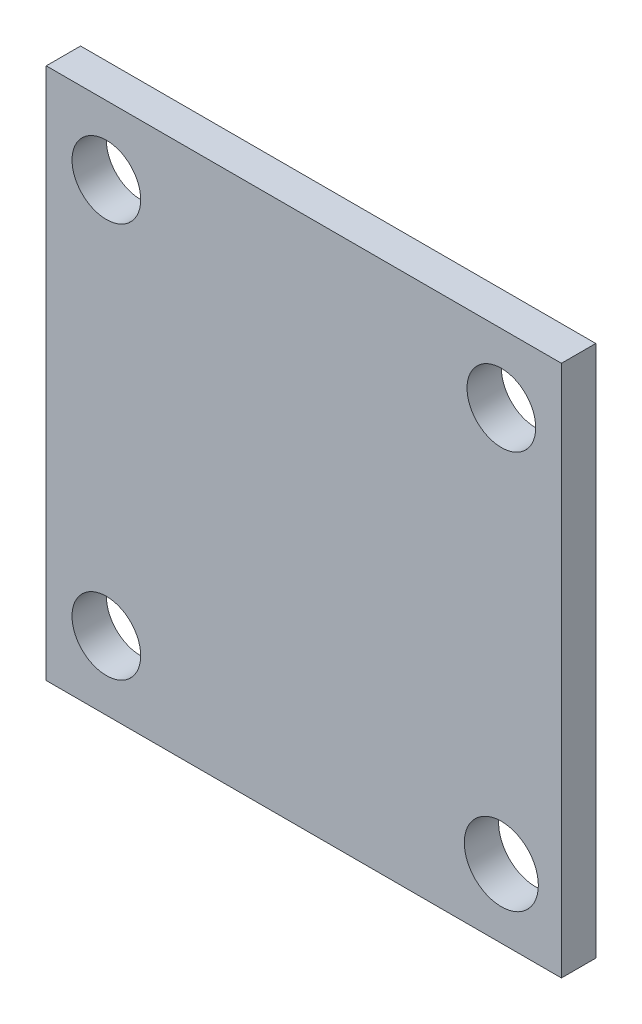
ISO-10303-21;
HEADER;
FILE_DESCRIPTION(('STEP AP214'),'2;1');
FILE_NAME('part.step','',(''),(''),'','','');
FILE_SCHEMA(('AUTOMOTIVE_DESIGN { 1 0 10303 214 1 1 1 1 }'));
ENDSEC;
DATA;
#1=APPLICATION_CONTEXT('core data for automotive mechanical design processes');
#2=APPLICATION_PROTOCOL_DEFINITION('international standard','automotive_design',2000,#1);
#3=PRODUCT_CONTEXT('',#1,'mechanical');
#4=PRODUCT('Part','Part','',(#3));
#5=PRODUCT_RELATED_PRODUCT_CATEGORY('part','',(#4));
#6=PRODUCT_DEFINITION_FORMATION('','',#4);
#7=PRODUCT_DEFINITION_CONTEXT('part definition',#1,'design');
#8=PRODUCT_DEFINITION('design','',#6,#7);
#9=PRODUCT_DEFINITION_SHAPE('','',#8);
#10=(LENGTH_UNIT() NAMED_UNIT(*) SI_UNIT(.MILLI.,.METRE.));
#11=(NAMED_UNIT(*) PLANE_ANGLE_UNIT() SI_UNIT($,.RADIAN.));
#12=(NAMED_UNIT(*) SI_UNIT($,.STERADIAN.) SOLID_ANGLE_UNIT());
#13=UNCERTAINTY_MEASURE_WITH_UNIT(LENGTH_MEASURE(1.E-05),#10,'distance_accuracy_value','');
#14=(GEOMETRIC_REPRESENTATION_CONTEXT(3) GLOBAL_UNCERTAINTY_ASSIGNED_CONTEXT((#13)) GLOBAL_UNIT_ASSIGNED_CONTEXT((#10,
#11,#12)) REPRESENTATION_CONTEXT('',''));
#15=CARTESIAN_POINT('',(0.,0.,0.));
#16=DIRECTION('',(0.,0.,1.));
#17=DIRECTION('',(1.,0.,0.));
#18=AXIS2_PLACEMENT_3D('',#15,#16,#17);
#19=CARTESIAN_POINT('',(0.,0.,2.));
#20=DIRECTION('',(0.,0.,1.));
#21=DIRECTION('',(1.,0.,0.));
#22=AXIS2_PLACEMENT_3D('',#19,#20,#21);
#23=PLANE('',#22);
#24=CARTESIAN_POINT('',(-11.501091744182,-11.4989082558181,2.));
#25=DIRECTION('',(0.,0.,1.));
#26=DIRECTION('',(1.,0.,0.));
#27=AXIS2_PLACEMENT_3D('',#24,#25,#26);
#28=CIRCLE('',#27,2.);
#29=CARTESIAN_POINT('',(-9.50109174418201,-11.4989082558181,2.));
#30=VERTEX_POINT('',#29);
#31=EDGE_CURVE('E142',#30,#30,#28,.T.);
#32=ORIENTED_EDGE('',*,*,#31,.F.);
#33=EDGE_LOOP('',(#32));
#34=FACE_BOUND('',#33,.T.);
#35=CARTESIAN_POINT('',(-11.4989082558179,11.5032752325463,2.));
#36=DIRECTION('',(0.,0.,1.));
#37=DIRECTION('',(1.,0.,0.));
#38=AXIS2_PLACEMENT_3D('',#35,#36,#37);
#39=CIRCLE('',#38,2.);
#40=CARTESIAN_POINT('',(-9.49890825581793,11.5032752325463,2.));
#41=VERTEX_POINT('',#40);
#42=EDGE_CURVE('E112',#41,#41,#39,.T.);
#43=ORIENTED_EDGE('',*,*,#42,.F.);
#44=EDGE_LOOP('',(#43));
#45=FACE_BOUND('',#44,.T.);
#46=DIRECTION('',(0.,1.,0.));
#47=VECTOR('',#46,1.);
#48=CARTESIAN_POINT('',(15.001091744182,-15.5010917441821,2.));
#49=LINE('',#48,#47);
#50=CARTESIAN_POINT('',(15.001091744182,-15.5010917441821,2.));
#51=VERTEX_POINT('',#50);
#52=CARTESIAN_POINT('',(15.001091744182,15.5010917441821,2.));
#53=VERTEX_POINT('',#52);
#54=EDGE_CURVE('E92',#51,#53,#49,.T.);
#55=ORIENTED_EDGE('',*,*,#54,.T.);
#56=DIRECTION('',(-1.,0.,0.));
#57=VECTOR('',#56,1.);
#58=CARTESIAN_POINT('',(15.001091744182,15.5010917441821,2.));
#59=LINE('',#58,#57);
#60=CARTESIAN_POINT('',(-15.001091744182,15.5010917441821,2.));
#61=VERTEX_POINT('',#60);
#62=EDGE_CURVE('E87',#53,#61,#59,.T.);
#63=ORIENTED_EDGE('',*,*,#62,.T.);
#64=DIRECTION('',(0.,-1.,0.));
#65=VECTOR('',#64,1.);
#66=CARTESIAN_POINT('',(-15.001091744182,-15.5010917441821,2.));
#67=LINE('',#66,#65);
#68=CARTESIAN_POINT('',(-15.001091744182,-15.5010917441821,2.));
#69=VERTEX_POINT('',#68);
#70=EDGE_CURVE('E90',#61,#69,#67,.T.);
#71=ORIENTED_EDGE('',*,*,#70,.T.);
#72=DIRECTION('',(1.,0.,0.));
#73=VECTOR('',#72,1.);
#74=CARTESIAN_POINT('',(15.001091744182,-15.5010917441821,2.));
#75=LINE('',#74,#73);
#76=EDGE_CURVE('E57',#69,#51,#75,.T.);
#77=ORIENTED_EDGE('',*,*,#76,.T.);
#78=EDGE_LOOP('',(#55,#63,#71,#77));
#79=FACE_BOUND('',#78,.T.);
#80=CARTESIAN_POINT('',(11.5032752325464,11.5010917441821,2.));
#81=DIRECTION('',(0.,0.,1.));
#82=DIRECTION('',(1.,0.,0.));
#83=AXIS2_PLACEMENT_3D('',#80,#81,#82);
#84=CIRCLE('',#83,2.);
#85=CARTESIAN_POINT('',(13.5032752325464,11.5010917441821,2.));
#86=VERTEX_POINT('',#85);
#87=EDGE_CURVE('E134',#86,#86,#84,.T.);
#88=ORIENTED_EDGE('',*,*,#87,.F.);
#89=EDGE_LOOP('',(#88));
#90=FACE_BOUND('',#89,.T.);
#91=CARTESIAN_POINT('',(11.5010917441823,-11.5010917441821,2.));
#92=DIRECTION('',(0.,0.,1.));
#93=DIRECTION('',(1.,0.,0.));
#94=AXIS2_PLACEMENT_3D('',#91,#92,#93);
#95=CIRCLE('',#94,2.15626689761665);
#96=CARTESIAN_POINT('',(13.657358641799,-11.5010917441821,2.));
#97=VERTEX_POINT('',#96);
#98=EDGE_CURVE('E150',#97,#97,#95,.T.);
#99=ORIENTED_EDGE('',*,*,#98,.F.);
#100=EDGE_LOOP('',(#99));
#101=FACE_BOUND('',#100,.T.);
#102=ADVANCED_FACE('F39',(#34,#45,#79,#90,#101),#23,.T.);
#103=CARTESIAN_POINT('',(0.,0.,0.));
#104=DIRECTION('',(0.,0.,1.));
#105=DIRECTION('',(1.,0.,0.));
#106=AXIS2_PLACEMENT_3D('',#103,#104,#105);
#107=PLANE('',#106);
#108=DIRECTION('',(0.,1.,0.));
#109=VECTOR('',#108,1.);
#110=CARTESIAN_POINT('',(15.001091744182,-15.5010917441821,0.));
#111=LINE('',#110,#109);
#112=CARTESIAN_POINT('',(15.001091744182,-15.5010917441821,0.));
#113=VERTEX_POINT('',#112);
#114=CARTESIAN_POINT('',(15.001091744182,15.5010917441821,0.));
#115=VERTEX_POINT('',#114);
#116=EDGE_CURVE('E108',#113,#115,#111,.T.);
#117=ORIENTED_EDGE('',*,*,#116,.F.);
#118=DIRECTION('',(1.,0.,0.));
#119=VECTOR('',#118,1.);
#120=CARTESIAN_POINT('',(15.001091744182,-15.5010917441821,0.));
#121=LINE('',#120,#119);
#122=CARTESIAN_POINT('',(-15.001091744182,-15.5010917441821,0.));
#123=VERTEX_POINT('',#122);
#124=EDGE_CURVE('E80',#123,#113,#121,.T.);
#125=ORIENTED_EDGE('',*,*,#124,.F.);
#126=DIRECTION('',(0.,-1.,0.));
#127=VECTOR('',#126,1.);
#128=CARTESIAN_POINT('',(-15.001091744182,-15.5010917441821,0.));
#129=LINE('',#128,#127);
#130=CARTESIAN_POINT('',(-15.001091744182,15.5010917441821,0.));
#131=VERTEX_POINT('',#130);
#132=EDGE_CURVE('E74',#131,#123,#129,.T.);
#133=ORIENTED_EDGE('',*,*,#132,.F.);
#134=DIRECTION('',(-1.,0.,0.));
#135=VECTOR('',#134,1.);
#136=CARTESIAN_POINT('',(15.001091744182,15.5010917441821,0.));
#137=LINE('',#136,#135);
#138=EDGE_CURVE('E97',#115,#131,#137,.T.);
#139=ORIENTED_EDGE('',*,*,#138,.F.);
#140=EDGE_LOOP('',(#117,#125,#133,#139));
#141=FACE_BOUND('',#140,.T.);
#142=CARTESIAN_POINT('',(-11.4989082558179,11.5032752325463,0.));
#143=DIRECTION('',(0.,0.,1.));
#144=DIRECTION('',(1.,0.,0.));
#145=AXIS2_PLACEMENT_3D('',#142,#143,#144);
#146=CIRCLE('',#145,2.);
#147=CARTESIAN_POINT('',(-9.49890825581793,11.5032752325463,0.));
#148=VERTEX_POINT('',#147);
#149=EDGE_CURVE('E130',#148,#148,#146,.T.);
#150=ORIENTED_EDGE('',*,*,#149,.T.);
#151=EDGE_LOOP('',(#150));
#152=FACE_BOUND('',#151,.T.);
#153=CARTESIAN_POINT('',(11.5032752325464,11.5010917441821,0.));
#154=DIRECTION('',(0.,0.,1.));
#155=DIRECTION('',(1.,0.,0.));
#156=AXIS2_PLACEMENT_3D('',#153,#154,#155);
#157=CIRCLE('',#156,2.);
#158=CARTESIAN_POINT('',(13.5032752325464,11.5010917441821,0.));
#159=VERTEX_POINT('',#158);
#160=EDGE_CURVE('E138',#159,#159,#157,.T.);
#161=ORIENTED_EDGE('',*,*,#160,.T.);
#162=EDGE_LOOP('',(#161));
#163=FACE_BOUND('',#162,.T.);
#164=CARTESIAN_POINT('',(-11.501091744182,-11.4989082558181,0.));
#165=DIRECTION('',(0.,0.,1.));
#166=DIRECTION('',(1.,0.,0.));
#167=AXIS2_PLACEMENT_3D('',#164,#165,#166);
#168=CIRCLE('',#167,2.);
#169=CARTESIAN_POINT('',(-9.50109174418201,-11.4989082558181,0.));
#170=VERTEX_POINT('',#169);
#171=EDGE_CURVE('E146',#170,#170,#168,.T.);
#172=ORIENTED_EDGE('',*,*,#171,.T.);
#173=EDGE_LOOP('',(#172));
#174=FACE_BOUND('',#173,.T.);
#175=CARTESIAN_POINT('',(11.5010917441823,-11.5010917441821,0.));
#176=DIRECTION('',(0.,0.,1.));
#177=DIRECTION('',(1.,0.,0.));
#178=AXIS2_PLACEMENT_3D('',#175,#176,#177);
#179=CIRCLE('',#178,2.15626689761665);
#180=CARTESIAN_POINT('',(13.657358641799,-11.5010917441821,0.));
#181=VERTEX_POINT('',#180);
#182=EDGE_CURVE('E154',#181,#181,#179,.T.);
#183=ORIENTED_EDGE('',*,*,#182,.T.);
#184=EDGE_LOOP('',(#183));
#185=FACE_BOUND('',#184,.T.);
#186=ADVANCED_FACE('F125',(#141,#152,#163,#174,#185),#107,.F.);
#187=CARTESIAN_POINT('',(15.001091744182,-15.5010917441821,2.));
#188=DIRECTION('',(-1.,0.,0.));
#189=DIRECTION('',(0.,0.,1.));
#190=AXIS2_PLACEMENT_3D('',#187,#188,#189);
#191=PLANE('',#190);
#192=ORIENTED_EDGE('',*,*,#116,.T.);
#193=DIRECTION('',(0.,0.,-1.));
#194=VECTOR('',#193,1.);
#195=CARTESIAN_POINT('',(15.001091744182,15.5010917441821,2.));
#196=LINE('',#195,#194);
#197=EDGE_CURVE('E11',#53,#115,#196,.T.);
#198=ORIENTED_EDGE('',*,*,#197,.F.);
#199=ORIENTED_EDGE('',*,*,#54,.F.);
#200=DIRECTION('',(0.,0.,-1.));
#201=VECTOR('',#200,1.);
#202=CARTESIAN_POINT('',(15.001091744182,-15.5010917441821,2.));
#203=LINE('',#202,#201);
#204=EDGE_CURVE('E104',#51,#113,#203,.T.);
#205=ORIENTED_EDGE('',*,*,#204,.T.);
#206=EDGE_LOOP('',(#192,#198,#199,#205));
#207=FACE_BOUND('',#206,.T.);
#208=ADVANCED_FACE('F41',(#207),#191,.F.);
#209=CARTESIAN_POINT('',(15.001091744182,15.5010917441821,2.));
#210=DIRECTION('',(0.,-1.,0.));
#211=DIRECTION('',(1.,0.,0.));
#212=AXIS2_PLACEMENT_3D('',#209,#210,#211);
#213=PLANE('',#212);
#214=ORIENTED_EDGE('',*,*,#138,.T.);
#215=DIRECTION('',(0.,0.,-1.));
#216=VECTOR('',#215,1.);
#217=CARTESIAN_POINT('',(-15.001091744182,15.5010917441821,2.));
#218=LINE('',#217,#216);
#219=EDGE_CURVE('E49',#61,#131,#218,.T.);
#220=ORIENTED_EDGE('',*,*,#219,.F.);
#221=ORIENTED_EDGE('',*,*,#62,.F.);
#222=ORIENTED_EDGE('',*,*,#197,.T.);
#223=EDGE_LOOP('',(#214,#220,#221,#222));
#224=FACE_BOUND('',#223,.T.);
#225=ADVANCED_FACE('F96',(#224),#213,.F.);
#226=CARTESIAN_POINT('',(-15.001091744182,-15.5010917441821,2.));
#227=DIRECTION('',(1.,0.,0.));
#228=DIRECTION('',(0.,0.,-1.));
#229=AXIS2_PLACEMENT_3D('',#226,#227,#228);
#230=PLANE('',#229);
#231=ORIENTED_EDGE('',*,*,#132,.T.);
#232=DIRECTION('',(0.,0.,-1.));
#233=VECTOR('',#232,1.);
#234=CARTESIAN_POINT('',(-15.001091744182,-15.5010917441821,2.));
#235=LINE('',#234,#233);
#236=EDGE_CURVE('E99',#69,#123,#235,.T.);
#237=ORIENTED_EDGE('',*,*,#236,.F.);
#238=ORIENTED_EDGE('',*,*,#70,.F.);
#239=ORIENTED_EDGE('',*,*,#219,.T.);
#240=EDGE_LOOP('',(#231,#237,#238,#239));
#241=FACE_BOUND('',#240,.T.);
#242=ADVANCED_FACE('F100',(#241),#230,.F.);
#243=CARTESIAN_POINT('',(15.001091744182,-15.5010917441821,2.));
#244=DIRECTION('',(0.,1.,0.));
#245=DIRECTION('',(-1.,0.,0.));
#246=AXIS2_PLACEMENT_3D('',#243,#244,#245);
#247=PLANE('',#246);
#248=ORIENTED_EDGE('',*,*,#124,.T.);
#249=ORIENTED_EDGE('',*,*,#204,.F.);
#250=ORIENTED_EDGE('',*,*,#76,.F.);
#251=ORIENTED_EDGE('',*,*,#236,.T.);
#252=EDGE_LOOP('',(#248,#249,#250,#251));
#253=FACE_BOUND('',#252,.T.);
#254=ADVANCED_FACE('F122',(#253),#247,.F.);
#255=CARTESIAN_POINT('',(-11.4989082558179,11.5032752325463,2.));
#256=DIRECTION('',(0.,0.,-1.));
#257=DIRECTION('',(-1.,0.,0.));
#258=AXIS2_PLACEMENT_3D('',#255,#256,#257);
#259=CYLINDRICAL_SURFACE('',#258,2.);
#260=ORIENTED_EDGE('',*,*,#42,.T.);
#261=EDGE_LOOP('',(#260));
#262=FACE_BOUND('',#261,.T.);
#263=ORIENTED_EDGE('',*,*,#149,.F.);
#264=EDGE_LOOP('',(#263));
#265=FACE_BOUND('',#264,.T.);
#266=ADVANCED_FACE('F175',(#262,#265),#259,.F.);
#267=CARTESIAN_POINT('',(11.5032752325464,11.5010917441821,2.));
#268=DIRECTION('',(0.,0.,-1.));
#269=DIRECTION('',(-1.,0.,0.));
#270=AXIS2_PLACEMENT_3D('',#267,#268,#269);
#271=CYLINDRICAL_SURFACE('',#270,2.);
#272=ORIENTED_EDGE('',*,*,#87,.T.);
#273=EDGE_LOOP('',(#272));
#274=FACE_BOUND('',#273,.T.);
#275=ORIENTED_EDGE('',*,*,#160,.F.);
#276=EDGE_LOOP('',(#275));
#277=FACE_BOUND('',#276,.T.);
#278=ADVANCED_FACE('F221',(#274,#277),#271,.F.);
#279=CARTESIAN_POINT('',(-11.501091744182,-11.4989082558181,2.));
#280=DIRECTION('',(0.,0.,-1.));
#281=DIRECTION('',(-1.,0.,0.));
#282=AXIS2_PLACEMENT_3D('',#279,#280,#281);
#283=CYLINDRICAL_SURFACE('',#282,2.);
#284=ORIENTED_EDGE('',*,*,#31,.T.);
#285=EDGE_LOOP('',(#284));
#286=FACE_BOUND('',#285,.T.);
#287=ORIENTED_EDGE('',*,*,#171,.F.);
#288=EDGE_LOOP('',(#287));
#289=FACE_BOUND('',#288,.T.);
#290=ADVANCED_FACE('F229',(#286,#289),#283,.F.);
#291=CARTESIAN_POINT('',(11.5010917441823,-11.5010917441821,2.));
#292=DIRECTION('',(0.,0.,-1.));
#293=DIRECTION('',(-1.,0.,0.));
#294=AXIS2_PLACEMENT_3D('',#291,#292,#293);
#295=CYLINDRICAL_SURFACE('',#294,2.15626689761665);
#296=ORIENTED_EDGE('',*,*,#98,.T.);
#297=EDGE_LOOP('',(#296));
#298=FACE_BOUND('',#297,.T.);
#299=ORIENTED_EDGE('',*,*,#182,.F.);
#300=EDGE_LOOP('',(#299));
#301=FACE_BOUND('',#300,.T.);
#302=ADVANCED_FACE('F162',(#298,#301),#295,.F.);
#303=CLOSED_SHELL('',(#102,#186,#208,#225,#242,#254,#266,#278,#290,#302));
#304=MANIFOLD_SOLID_BREP('B2',#303);
#305=ADVANCED_BREP_SHAPE_REPRESENTATION('',(#18,#304),#14);
#306=SHAPE_DEFINITION_REPRESENTATION(#9,#305);
ENDSEC;
END-ISO-10303-21;
